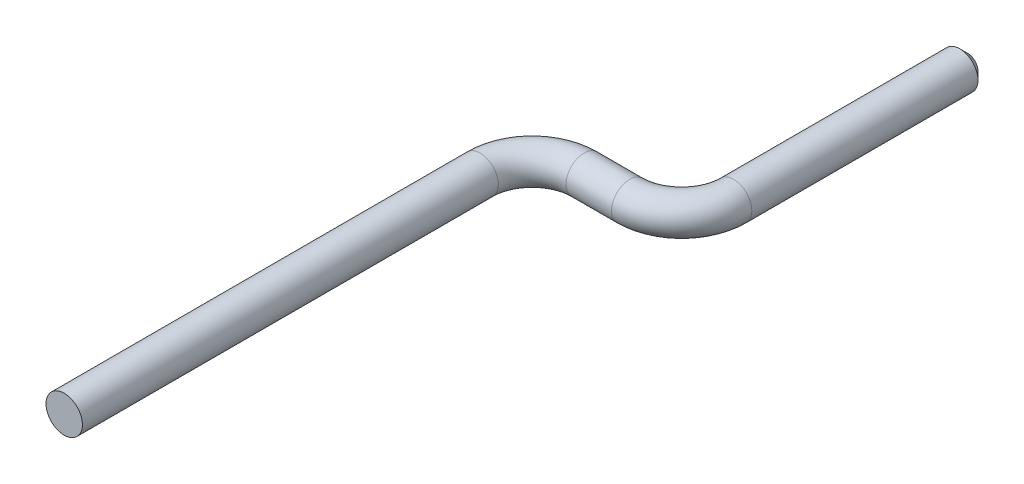
ISO-10303-21;
HEADER;
FILE_DESCRIPTION(('STEP AP214'),'2;1');
FILE_NAME('part.step','',(''),(''),'','','');
FILE_SCHEMA(('AUTOMOTIVE_DESIGN { 1 0 10303 214 1 1 1 1 }'));
ENDSEC;
DATA;
#1=APPLICATION_CONTEXT('core data for automotive mechanical design processes');
#2=APPLICATION_PROTOCOL_DEFINITION('international standard','automotive_design',2000,#1);
#3=PRODUCT_CONTEXT('',#1,'mechanical');
#4=PRODUCT('Part','Part','',(#3));
#5=PRODUCT_RELATED_PRODUCT_CATEGORY('part','',(#4));
#6=PRODUCT_DEFINITION_FORMATION('','',#4);
#7=PRODUCT_DEFINITION_CONTEXT('part definition',#1,'design');
#8=PRODUCT_DEFINITION('design','',#6,#7);
#9=PRODUCT_DEFINITION_SHAPE('','',#8);
#10=(LENGTH_UNIT() NAMED_UNIT(*) SI_UNIT(.MILLI.,.METRE.));
#11=(NAMED_UNIT(*) PLANE_ANGLE_UNIT() SI_UNIT($,.RADIAN.));
#12=(NAMED_UNIT(*) SI_UNIT($,.STERADIAN.) SOLID_ANGLE_UNIT());
#13=UNCERTAINTY_MEASURE_WITH_UNIT(LENGTH_MEASURE(1.E-05),#10,'distance_accuracy_value','');
#14=(GEOMETRIC_REPRESENTATION_CONTEXT(3) GLOBAL_UNCERTAINTY_ASSIGNED_CONTEXT((#13)) GLOBAL_UNIT_ASSIGNED_CONTEXT((#10,
#11,#12)) REPRESENTATION_CONTEXT('',''));
#15=CARTESIAN_POINT('',(0.,0.,0.));
#16=DIRECTION('',(0.,0.,1.));
#17=DIRECTION('',(1.,0.,0.));
#18=AXIS2_PLACEMENT_3D('',#15,#16,#17);
#19=CARTESIAN_POINT('',(0.,0.,0.));
#20=DIRECTION('',(0.,0.,1.));
#21=DIRECTION('',(1.,0.,0.));
#22=AXIS2_PLACEMENT_3D('',#19,#20,#21);
#23=PLANE('',#22);
#24=CARTESIAN_POINT('',(0.,0.,0.));
#25=DIRECTION('',(0.,0.,1.));
#26=DIRECTION('',(1.,0.,0.));
#27=AXIS2_PLACEMENT_3D('',#24,#25,#26);
#28=CIRCLE('',#27,0.7);
#29=CARTESIAN_POINT('',(0.7,0.,0.));
#30=VERTEX_POINT('',#29);
#31=EDGE_CURVE('E43',#30,#30,#28,.T.);
#32=ORIENTED_EDGE('',*,*,#31,.T.);
#33=EDGE_LOOP('',(#32));
#34=FACE_BOUND('',#33,.T.);
#35=ADVANCED_FACE('F32',(#34),#23,.T.);
#36=CARTESIAN_POINT('',(5.75,0.,-29.));
#37=DIRECTION('',(0.,0.,1.));
#38=DIRECTION('',(1.,0.,0.));
#39=AXIS2_PLACEMENT_3D('',#36,#37,#38);
#40=PLANE('',#39);
#41=CARTESIAN_POINT('',(5.75,0.,-29.));
#42=DIRECTION('',(0.,0.,1.));
#43=DIRECTION('',(1.,0.,0.));
#44=AXIS2_PLACEMENT_3D('',#41,#42,#43);
#45=CIRCLE('',#44,0.400000000000005);
#46=CARTESIAN_POINT('',(6.15,0.,-29.));
#47=VERTEX_POINT('',#46);
#48=EDGE_CURVE('E11',#47,#47,#45,.F.);
#49=ORIENTED_EDGE('',*,*,#48,.T.);
#50=EDGE_LOOP('',(#49));
#51=FACE_BOUND('',#50,.T.);
#52=ADVANCED_FACE('F74',(#51),#40,.F.);
#53=CARTESIAN_POINT('',(0.,0.,0.));
#54=DIRECTION('',(0.,0.,-1.));
#55=DIRECTION('',(-1.,0.,0.));
#56=AXIS2_PLACEMENT_3D('',#53,#54,#55);
#57=CYLINDRICAL_SURFACE('',#56,0.7);
#58=CARTESIAN_POINT('',(0.,0.,-16.));
#59=DIRECTION('',(0.,0.,1.));
#60=DIRECTION('',(1.,0.,0.));
#61=AXIS2_PLACEMENT_3D('',#58,#59,#60);
#62=CIRCLE('',#61,0.7);
#63=CARTESIAN_POINT('',(-0.700000000000001,0.,-16.));
#64=VERTEX_POINT('',#63);
#65=EDGE_CURVE('E46',#64,#64,#62,.T.);
#66=ORIENTED_EDGE('',*,*,#65,.T.);
#67=EDGE_LOOP('',(#66));
#68=FACE_BOUND('',#67,.T.);
#69=ORIENTED_EDGE('',*,*,#31,.F.);
#70=EDGE_LOOP('',(#69));
#71=FACE_BOUND('',#70,.T.);
#72=ADVANCED_FACE('F44',(#68,#71),#57,.T.);
#73=CARTESIAN_POINT('',(2.,0.,-16.));
#74=DIRECTION('',(0.,-1.,0.));
#75=DIRECTION('',(0.,0.,-1.));
#76=AXIS2_PLACEMENT_3D('',#73,#74,#75);
#77=TOROIDAL_SURFACE('',#76,2.,0.7);
#78=CARTESIAN_POINT('',(2.,0.,-18.));
#79=DIRECTION('',(-1.,0.,0.));
#80=DIRECTION('',(0.,0.,1.));
#81=AXIS2_PLACEMENT_3D('',#78,#79,#80);
#82=CIRCLE('',#81,0.7);
#83=CARTESIAN_POINT('',(2.,0.,-18.7));
#84=VERTEX_POINT('',#83);
#85=EDGE_CURVE('E49',#84,#84,#82,.T.);
#86=CARTESIAN_POINT('',(2.,0.,-16.));
#87=DIRECTION('',(0.,-1.,0.));
#88=DIRECTION('',(0.,0.,-1.));
#89=AXIS2_PLACEMENT_3D('',#86,#87,#88);
#90=CIRCLE('',#89,2.7);
#91=EDGE_CURVE('',#64,#84,#90,.T.);
#92=ORIENTED_EDGE('',*,*,#65,.F.);
#93=ORIENTED_EDGE('',*,*,#85,.T.);
#94=ORIENTED_EDGE('',*,*,#91,.T.);
#95=ORIENTED_EDGE('',*,*,#91,.F.);
#96=EDGE_LOOP('',(#92,#94,#93,#95));
#97=FACE_BOUND('',#96,.T.);
#98=ADVANCED_FACE('F87',(#97),#77,.T.);
#99=CARTESIAN_POINT('',(2.,0.,-18.));
#100=DIRECTION('',(1.,0.,0.));
#101=DIRECTION('',(0.,0.,-1.));
#102=AXIS2_PLACEMENT_3D('',#99,#100,#101);
#103=CYLINDRICAL_SURFACE('',#102,0.7);
#104=CARTESIAN_POINT('',(3.75,0.,-18.));
#105=DIRECTION('',(-1.,0.,0.));
#106=DIRECTION('',(0.,0.,1.));
#107=AXIS2_PLACEMENT_3D('',#104,#105,#106);
#108=CIRCLE('',#107,0.7);
#109=CARTESIAN_POINT('',(3.75,0.,-17.3));
#110=VERTEX_POINT('',#109);
#111=EDGE_CURVE('E54',#110,#110,#108,.T.);
#112=ORIENTED_EDGE('',*,*,#111,.T.);
#113=EDGE_LOOP('',(#112));
#114=FACE_BOUND('',#113,.T.);
#115=ORIENTED_EDGE('',*,*,#85,.F.);
#116=EDGE_LOOP('',(#115));
#117=FACE_BOUND('',#116,.T.);
#118=ADVANCED_FACE('F83',(#114,#117),#103,.T.);
#119=CARTESIAN_POINT('',(3.75,0.,-20.));
#120=DIRECTION('',(0.,1.,0.));
#121=DIRECTION('',(0.,0.,1.));
#122=AXIS2_PLACEMENT_3D('',#119,#120,#121);
#123=TOROIDAL_SURFACE('',#122,2.,0.7);
#124=CARTESIAN_POINT('',(5.75,0.,-20.));
#125=DIRECTION('',(0.,0.,1.));
#126=DIRECTION('',(1.,0.,0.));
#127=AXIS2_PLACEMENT_3D('',#124,#125,#126);
#128=CIRCLE('',#127,0.7);
#129=CARTESIAN_POINT('',(6.45,0.,-20.));
#130=VERTEX_POINT('',#129);
#131=EDGE_CURVE('E57',#130,#130,#128,.T.);
#132=CARTESIAN_POINT('',(3.75,0.,-20.));
#133=DIRECTION('',(0.,1.,0.));
#134=DIRECTION('',(0.,0.,1.));
#135=AXIS2_PLACEMENT_3D('',#132,#133,#134);
#136=CIRCLE('',#135,2.7);
#137=EDGE_CURVE('',#110,#130,#136,.T.);
#138=ORIENTED_EDGE('',*,*,#111,.F.);
#139=ORIENTED_EDGE('',*,*,#131,.T.);
#140=ORIENTED_EDGE('',*,*,#137,.T.);
#141=ORIENTED_EDGE('',*,*,#137,.F.);
#142=EDGE_LOOP('',(#138,#140,#139,#141));
#143=FACE_BOUND('',#142,.T.);
#144=ADVANCED_FACE('F70',(#143),#123,.T.);
#145=CARTESIAN_POINT('',(5.75,0.,-20.));
#146=DIRECTION('',(0.,0.,-1.));
#147=DIRECTION('',(-1.,0.,0.));
#148=AXIS2_PLACEMENT_3D('',#145,#146,#147);
#149=CYLINDRICAL_SURFACE('',#148,0.7);
#150=CARTESIAN_POINT('',(5.75,0.,-28.7));
#151=DIRECTION('',(0.,0.,1.));
#152=DIRECTION('',(1.,0.,0.));
#153=AXIS2_PLACEMENT_3D('',#150,#151,#152);
#154=CIRCLE('',#153,0.7);
#155=CARTESIAN_POINT('',(6.45,0.,-28.7));
#156=VERTEX_POINT('',#155);
#157=EDGE_CURVE('E39',#156,#156,#154,.T.);
#158=ORIENTED_EDGE('',*,*,#157,.T.);
#159=EDGE_LOOP('',(#158));
#160=FACE_BOUND('',#159,.T.);
#161=ORIENTED_EDGE('',*,*,#131,.F.);
#162=EDGE_LOOP('',(#161));
#163=FACE_BOUND('',#162,.T.);
#164=ADVANCED_FACE('F62',(#160,#163),#149,.T.);
#165=CARTESIAN_POINT('',(5.75,0.,-28.7));
#166=DIRECTION('',(0.,0.,1.));
#167=DIRECTION('',(1.,0.,0.));
#168=AXIS2_PLACEMENT_3D('',#165,#166,#167);
#169=CONICAL_SURFACE('',#168,0.7,0.785398163397444);
#170=ORIENTED_EDGE('',*,*,#48,.F.);
#171=EDGE_LOOP('',(#170));
#172=FACE_BOUND('',#171,.T.);
#173=ORIENTED_EDGE('',*,*,#157,.F.);
#174=EDGE_LOOP('',(#173));
#175=FACE_BOUND('',#174,.T.);
#176=ADVANCED_FACE('F34',(#172,#175),#169,.T.);
#177=CLOSED_SHELL('',(#35,#52,#72,#98,#118,#144,#164,#176));
#178=MANIFOLD_SOLID_BREP('B2',#177);
#179=ADVANCED_BREP_SHAPE_REPRESENTATION('',(#18,#178),#14);
#180=SHAPE_DEFINITION_REPRESENTATION(#9,#179);
ENDSEC;
END-ISO-10303-21;
